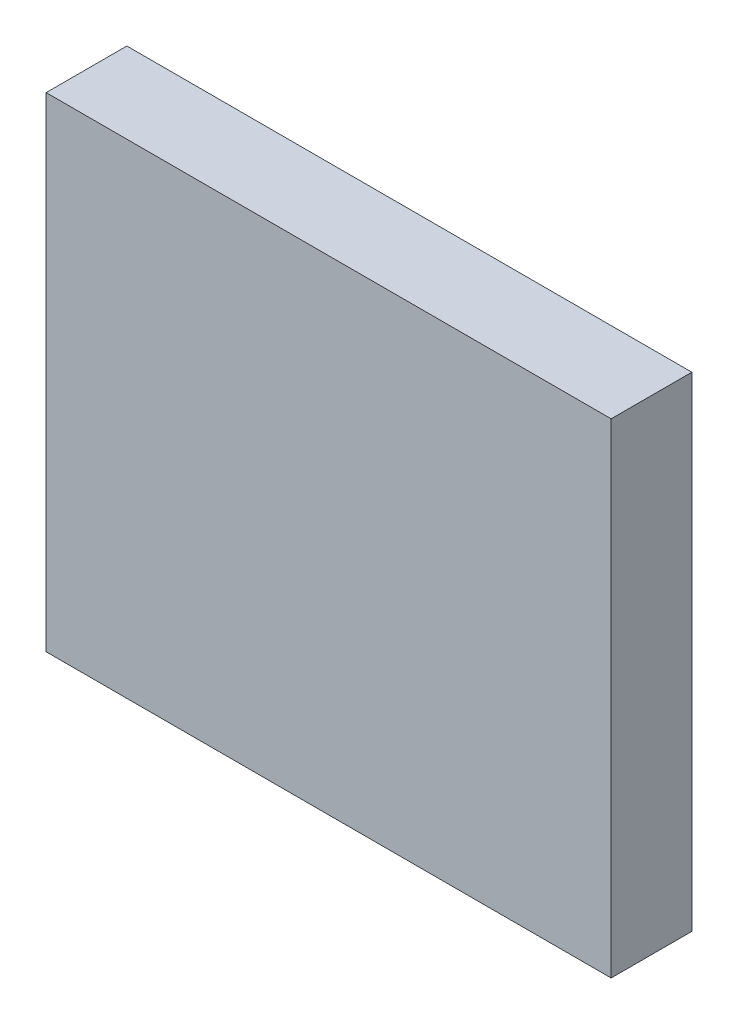
ISO-10303-21;
HEADER;
FILE_DESCRIPTION(('STEP AP214'),'2;1');
FILE_NAME('part.step','',(''),(''),'','','');
FILE_SCHEMA(('AUTOMOTIVE_DESIGN { 1 0 10303 214 1 1 1 1 }'));
ENDSEC;
DATA;
#1=APPLICATION_CONTEXT('core data for automotive mechanical design processes');
#2=APPLICATION_PROTOCOL_DEFINITION('international standard','automotive_design',2000,#1);
#3=PRODUCT_CONTEXT('',#1,'mechanical');
#4=PRODUCT('Part','Part','',(#3));
#5=PRODUCT_RELATED_PRODUCT_CATEGORY('part','',(#4));
#6=PRODUCT_DEFINITION_FORMATION('','',#4);
#7=PRODUCT_DEFINITION_CONTEXT('part definition',#1,'design');
#8=PRODUCT_DEFINITION('design','',#6,#7);
#9=PRODUCT_DEFINITION_SHAPE('','',#8);
#10=(LENGTH_UNIT() NAMED_UNIT(*) SI_UNIT(.MILLI.,.METRE.));
#11=(NAMED_UNIT(*) PLANE_ANGLE_UNIT() SI_UNIT($,.RADIAN.));
#12=(NAMED_UNIT(*) SI_UNIT($,.STERADIAN.) SOLID_ANGLE_UNIT());
#13=UNCERTAINTY_MEASURE_WITH_UNIT(LENGTH_MEASURE(1.E-05),#10,'distance_accuracy_value','');
#14=(GEOMETRIC_REPRESENTATION_CONTEXT(3) GLOBAL_UNCERTAINTY_ASSIGNED_CONTEXT((#13)) GLOBAL_UNIT_ASSIGNED_CONTEXT((#10,
#11,#12)) REPRESENTATION_CONTEXT('',''));
#15=CARTESIAN_POINT('',(0.,0.,0.));
#16=DIRECTION('',(0.,0.,1.));
#17=DIRECTION('',(1.,0.,0.));
#18=AXIS2_PLACEMENT_3D('',#15,#16,#17);
#19=CARTESIAN_POINT('',(14.,-12.,4.));
#20=DIRECTION('',(-1.,0.,0.));
#21=DIRECTION('',(0.,0.,1.));
#22=AXIS2_PLACEMENT_3D('',#19,#20,#21);
#23=PLANE('',#22);
#24=DIRECTION('',(0.,1.,0.));
#25=VECTOR('',#24,1.);
#26=CARTESIAN_POINT('',(14.,-12.,0.));
#27=LINE('',#26,#25);
#28=CARTESIAN_POINT('',(14.,-12.,0.));
#29=VERTEX_POINT('',#28);
#30=CARTESIAN_POINT('',(14.,12.,0.));
#31=VERTEX_POINT('',#30);
#32=EDGE_CURVE('E100',#29,#31,#27,.T.);
#33=ORIENTED_EDGE('',*,*,#32,.T.);
#34=DIRECTION('',(0.,0.,-1.));
#35=VECTOR('',#34,1.);
#36=CARTESIAN_POINT('',(14.,12.,4.));
#37=LINE('',#36,#35);
#38=CARTESIAN_POINT('',(14.,12.,4.));
#39=VERTEX_POINT('',#38);
#40=EDGE_CURVE('E11',#39,#31,#37,.T.);
#41=ORIENTED_EDGE('',*,*,#40,.F.);
#42=DIRECTION('',(0.,1.,0.));
#43=VECTOR('',#42,1.);
#44=CARTESIAN_POINT('',(14.,-12.,4.));
#45=LINE('',#44,#43);
#46=CARTESIAN_POINT('',(14.,-12.,4.));
#47=VERTEX_POINT('',#46);
#48=EDGE_CURVE('E88',#47,#39,#45,.T.);
#49=ORIENTED_EDGE('',*,*,#48,.F.);
#50=DIRECTION('',(0.,0.,-1.));
#51=VECTOR('',#50,1.);
#52=CARTESIAN_POINT('',(14.,-12.,4.));
#53=LINE('',#52,#51);
#54=EDGE_CURVE('E96',#47,#29,#53,.T.);
#55=ORIENTED_EDGE('',*,*,#54,.T.);
#56=EDGE_LOOP('',(#33,#41,#49,#55));
#57=FACE_BOUND('',#56,.T.);
#58=ADVANCED_FACE('F37',(#57),#23,.F.);
#59=CARTESIAN_POINT('',(-14.,12.,4.));
#60=DIRECTION('',(0.,-1.,0.));
#61=DIRECTION('',(0.,0.,-1.));
#62=AXIS2_PLACEMENT_3D('',#59,#60,#61);
#63=PLANE('',#62);
#64=DIRECTION('',(-1.,0.,0.));
#65=VECTOR('',#64,1.);
#66=CARTESIAN_POINT('',(-14.,12.,0.));
#67=LINE('',#66,#65);
#68=CARTESIAN_POINT('',(-14.,12.,0.));
#69=VERTEX_POINT('',#68);
#70=EDGE_CURVE('E92',#31,#69,#67,.T.);
#71=ORIENTED_EDGE('',*,*,#70,.T.);
#72=DIRECTION('',(0.,0.,-1.));
#73=VECTOR('',#72,1.);
#74=CARTESIAN_POINT('',(-14.,12.,4.));
#75=LINE('',#74,#73);
#76=CARTESIAN_POINT('',(-14.,12.,4.));
#77=VERTEX_POINT('',#76);
#78=EDGE_CURVE('E45',#77,#69,#75,.T.);
#79=ORIENTED_EDGE('',*,*,#78,.F.);
#80=DIRECTION('',(-1.,0.,0.));
#81=VECTOR('',#80,1.);
#82=CARTESIAN_POINT('',(-14.,12.,4.));
#83=LINE('',#82,#81);
#84=EDGE_CURVE('E83',#39,#77,#83,.T.);
#85=ORIENTED_EDGE('',*,*,#84,.F.);
#86=ORIENTED_EDGE('',*,*,#40,.T.);
#87=EDGE_LOOP('',(#71,#79,#85,#86));
#88=FACE_BOUND('',#87,.T.);
#89=ADVANCED_FACE('F91',(#88),#63,.F.);
#90=CARTESIAN_POINT('',(-14.,-12.,4.));
#91=DIRECTION('',(1.,0.,0.));
#92=DIRECTION('',(0.,0.,-1.));
#93=AXIS2_PLACEMENT_3D('',#90,#91,#92);
#94=PLANE('',#93);
#95=DIRECTION('',(0.,-1.,0.));
#96=VECTOR('',#95,1.);
#97=CARTESIAN_POINT('',(-14.,-12.,0.));
#98=LINE('',#97,#96);
#99=CARTESIAN_POINT('',(-14.,-12.,0.));
#100=VERTEX_POINT('',#99);
#101=EDGE_CURVE('E70',#69,#100,#98,.T.);
#102=ORIENTED_EDGE('',*,*,#101,.T.);
#103=DIRECTION('',(0.,0.,-1.));
#104=VECTOR('',#103,1.);
#105=CARTESIAN_POINT('',(-14.,-12.,4.));
#106=LINE('',#105,#104);
#107=CARTESIAN_POINT('',(-14.,-12.,4.));
#108=VERTEX_POINT('',#107);
#109=EDGE_CURVE('E93',#108,#100,#106,.T.);
#110=ORIENTED_EDGE('',*,*,#109,.F.);
#111=DIRECTION('',(0.,-1.,0.));
#112=VECTOR('',#111,1.);
#113=CARTESIAN_POINT('',(-14.,-12.,4.));
#114=LINE('',#113,#112);
#115=EDGE_CURVE('E86',#77,#108,#114,.T.);
#116=ORIENTED_EDGE('',*,*,#115,.F.);
#117=ORIENTED_EDGE('',*,*,#78,.T.);
#118=EDGE_LOOP('',(#102,#110,#116,#117));
#119=FACE_BOUND('',#118,.T.);
#120=ADVANCED_FACE('F94',(#119),#94,.F.);
#121=CARTESIAN_POINT('',(-14.,-12.,4.));
#122=DIRECTION('',(0.,1.,0.));
#123=DIRECTION('',(0.,0.,1.));
#124=AXIS2_PLACEMENT_3D('',#121,#122,#123);
#125=PLANE('',#124);
#126=DIRECTION('',(1.,0.,0.));
#127=VECTOR('',#126,1.);
#128=CARTESIAN_POINT('',(-14.,-12.,0.));
#129=LINE('',#128,#127);
#130=EDGE_CURVE('E76',#100,#29,#129,.T.);
#131=ORIENTED_EDGE('',*,*,#130,.T.);
#132=ORIENTED_EDGE('',*,*,#54,.F.);
#133=DIRECTION('',(1.,0.,0.));
#134=VECTOR('',#133,1.);
#135=CARTESIAN_POINT('',(-14.,-12.,4.));
#136=LINE('',#135,#134);
#137=EDGE_CURVE('E53',#108,#47,#136,.T.);
#138=ORIENTED_EDGE('',*,*,#137,.F.);
#139=ORIENTED_EDGE('',*,*,#109,.T.);
#140=EDGE_LOOP('',(#131,#132,#138,#139));
#141=FACE_BOUND('',#140,.T.);
#142=ADVANCED_FACE('F107',(#141),#125,.F.);
#143=CARTESIAN_POINT('',(0.,0.,4.));
#144=DIRECTION('',(0.,0.,-1.));
#145=DIRECTION('',(-1.,0.,0.));
#146=AXIS2_PLACEMENT_3D('',#143,#144,#145);
#147=PLANE('',#146);
#148=ORIENTED_EDGE('',*,*,#48,.T.);
#149=ORIENTED_EDGE('',*,*,#84,.T.);
#150=ORIENTED_EDGE('',*,*,#115,.T.);
#151=ORIENTED_EDGE('',*,*,#137,.T.);
#152=EDGE_LOOP('',(#148,#149,#150,#151));
#153=FACE_BOUND('',#152,.T.);
#154=ADVANCED_FACE('F84',(#153),#147,.F.);
#155=CARTESIAN_POINT('',(0.,0.,0.));
#156=DIRECTION('',(0.,0.,-1.));
#157=DIRECTION('',(-1.,0.,0.));
#158=AXIS2_PLACEMENT_3D('',#155,#156,#157);
#159=PLANE('',#158);
#160=ORIENTED_EDGE('',*,*,#32,.F.);
#161=ORIENTED_EDGE('',*,*,#130,.F.);
#162=ORIENTED_EDGE('',*,*,#101,.F.);
#163=ORIENTED_EDGE('',*,*,#70,.F.);
#164=EDGE_LOOP('',(#160,#161,#162,#163));
#165=FACE_BOUND('',#164,.T.);
#166=ADVANCED_FACE('F110',(#165),#159,.T.);
#167=CLOSED_SHELL('',(#58,#89,#120,#142,#154,#166));
#168=MANIFOLD_SOLID_BREP('B2',#167);
#169=ADVANCED_BREP_SHAPE_REPRESENTATION('',(#18,#168),#14);
#170=SHAPE_DEFINITION_REPRESENTATION(#9,#169);
ENDSEC;
END-ISO-10303-21;
